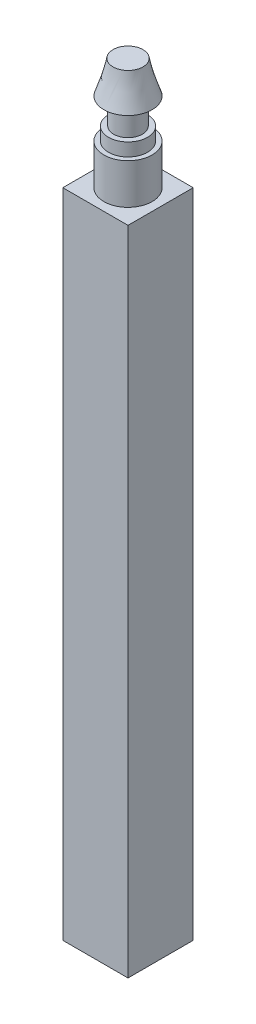
ISO-10303-21;
HEADER;
FILE_DESCRIPTION(('STEP AP214'),'2;1');
FILE_NAME('part.step','',(''),(''),'','','');
FILE_SCHEMA(('AUTOMOTIVE_DESIGN { 1 0 10303 214 1 1 1 1 }'));
ENDSEC;
DATA;
#1=APPLICATION_CONTEXT('core data for automotive mechanical design processes');
#2=APPLICATION_PROTOCOL_DEFINITION('international standard','automotive_design',2000,#1);
#3=PRODUCT_CONTEXT('',#1,'mechanical');
#4=PRODUCT('Part','Part','',(#3));
#5=PRODUCT_RELATED_PRODUCT_CATEGORY('part','',(#4));
#6=PRODUCT_DEFINITION_FORMATION('','',#4);
#7=PRODUCT_DEFINITION_CONTEXT('part definition',#1,'design');
#8=PRODUCT_DEFINITION('design','',#6,#7);
#9=PRODUCT_DEFINITION_SHAPE('','',#8);
#10=(LENGTH_UNIT() NAMED_UNIT(*) SI_UNIT(.MILLI.,.METRE.));
#11=(NAMED_UNIT(*) PLANE_ANGLE_UNIT() SI_UNIT($,.RADIAN.));
#12=(NAMED_UNIT(*) SI_UNIT($,.STERADIAN.) SOLID_ANGLE_UNIT());
#13=UNCERTAINTY_MEASURE_WITH_UNIT(LENGTH_MEASURE(1.E-05),#10,'distance_accuracy_value','');
#14=(GEOMETRIC_REPRESENTATION_CONTEXT(3) GLOBAL_UNCERTAINTY_ASSIGNED_CONTEXT((#13)) GLOBAL_UNIT_ASSIGNED_CONTEXT((#10,
#11,#12)) REPRESENTATION_CONTEXT('',''));
#15=CARTESIAN_POINT('',(0.,0.,0.));
#16=DIRECTION('',(0.,0.,1.));
#17=DIRECTION('',(1.,0.,0.));
#18=AXIS2_PLACEMENT_3D('',#15,#16,#17);
#19=CARTESIAN_POINT('',(0.,3.1,0.));
#20=DIRECTION('',(0.,-1.,0.));
#21=DIRECTION('',(0.,0.,-1.));
#22=AXIS2_PLACEMENT_3D('',#19,#20,#21);
#23=CYLINDRICAL_SURFACE('',#22,1.85);
#24=CARTESIAN_POINT('',(0.,3.1,0.));
#25=DIRECTION('',(0.,1.,0.));
#26=DIRECTION('',(0.,0.,1.));
#27=AXIS2_PLACEMENT_3D('',#24,#25,#26);
#28=CIRCLE('',#27,1.85);
#29=CARTESIAN_POINT('',(0.,3.1,-1.85));
#30=VERTEX_POINT('',#29);
#31=EDGE_CURVE('E175',#30,#30,#28,.T.);
#32=CARTESIAN_POINT('',(0.,0.,0.));
#33=DIRECTION('',(0.,1.,0.));
#34=DIRECTION('',(0.,0.,1.));
#35=AXIS2_PLACEMENT_3D('',#32,#33,#34);
#36=CIRCLE('',#35,1.85);
#37=CARTESIAN_POINT('',(0.,0.,-1.85));
#38=VERTEX_POINT('',#37);
#39=EDGE_CURVE('E42',#38,#38,#36,.T.);
#40=CARTESIAN_POINT('',(0.,3.1,-1.85));
#41=CARTESIAN_POINT('',(0.,3.06770833333333,-1.85));
#42=CARTESIAN_POINT('',(0.,3.03541666666667,-1.85));
#43=CARTESIAN_POINT('',(0.,2.97083333333333,-1.85));
#44=CARTESIAN_POINT('',(0.,2.93854166666667,-1.85));
#45=CARTESIAN_POINT('',(0.,2.87395833333333,-1.85));
#46=CARTESIAN_POINT('',(0.,2.84166666666667,-1.85));
#47=CARTESIAN_POINT('',(0.,2.77708333333333,-1.85));
#48=CARTESIAN_POINT('',(0.,2.74479166666667,-1.85));
#49=CARTESIAN_POINT('',(0.,2.68020833333333,-1.85));
#50=CARTESIAN_POINT('',(0.,2.64791666666667,-1.85));
#51=CARTESIAN_POINT('',(0.,2.58333333333333,-1.85));
#52=CARTESIAN_POINT('',(0.,2.55104166666667,-1.85));
#53=CARTESIAN_POINT('',(0.,2.48645833333333,-1.85));
#54=CARTESIAN_POINT('',(0.,2.45416666666667,-1.85));
#55=CARTESIAN_POINT('',(0.,2.38958333333333,-1.85));
#56=CARTESIAN_POINT('',(0.,2.35729166666667,-1.85));
#57=CARTESIAN_POINT('',(0.,2.29270833333333,-1.85));
#58=CARTESIAN_POINT('',(0.,2.26041666666667,-1.85));
#59=CARTESIAN_POINT('',(0.,2.19583333333333,-1.85));
#60=CARTESIAN_POINT('',(0.,2.16354166666667,-1.85));
#61=CARTESIAN_POINT('',(0.,2.09895833333333,-1.85));
#62=CARTESIAN_POINT('',(0.,2.06666666666667,-1.85));
#63=CARTESIAN_POINT('',(0.,2.00208333333333,-1.85));
#64=CARTESIAN_POINT('',(0.,1.96979166666667,-1.85));
#65=CARTESIAN_POINT('',(0.,1.90520833333333,-1.85));
#66=CARTESIAN_POINT('',(0.,1.87291666666667,-1.85));
#67=CARTESIAN_POINT('',(0.,1.80833333333333,-1.85));
#68=CARTESIAN_POINT('',(0.,1.77604166666667,-1.85));
#69=CARTESIAN_POINT('',(0.,1.71145833333333,-1.85));
#70=CARTESIAN_POINT('',(0.,1.67916666666667,-1.85));
#71=CARTESIAN_POINT('',(0.,1.61458333333333,-1.85));
#72=CARTESIAN_POINT('',(0.,1.58229166666667,-1.85));
#73=CARTESIAN_POINT('',(0.,1.51770833333333,-1.85));
#74=CARTESIAN_POINT('',(0.,1.48541666666667,-1.85));
#75=CARTESIAN_POINT('',(0.,1.42083333333333,-1.85));
#76=CARTESIAN_POINT('',(0.,1.38854166666667,-1.85));
#77=CARTESIAN_POINT('',(0.,1.32395833333333,-1.85));
#78=CARTESIAN_POINT('',(0.,1.29166666666667,-1.85));
#79=CARTESIAN_POINT('',(0.,1.22708333333333,-1.85));
#80=CARTESIAN_POINT('',(0.,1.19479166666667,-1.85));
#81=CARTESIAN_POINT('',(0.,1.13020833333333,-1.85));
#82=CARTESIAN_POINT('',(0.,1.09791666666667,-1.85));
#83=CARTESIAN_POINT('',(0.,1.03333333333333,-1.85));
#84=CARTESIAN_POINT('',(0.,1.00104166666667,-1.85));
#85=CARTESIAN_POINT('',(0.,0.936458333333333,-1.85));
#86=CARTESIAN_POINT('',(0.,0.904166666666667,-1.85));
#87=CARTESIAN_POINT('',(0.,0.839583333333333,-1.85));
#88=CARTESIAN_POINT('',(0.,0.807291666666667,-1.85));
#89=CARTESIAN_POINT('',(0.,0.742708333333333,-1.85));
#90=CARTESIAN_POINT('',(0.,0.710416666666667,-1.85));
#91=CARTESIAN_POINT('',(0.,0.645833333333333,-1.85));
#92=CARTESIAN_POINT('',(0.,0.613541666666667,-1.85));
#93=CARTESIAN_POINT('',(0.,0.548958333333333,-1.85));
#94=CARTESIAN_POINT('',(0.,0.516666666666667,-1.85));
#95=CARTESIAN_POINT('',(0.,0.452083333333333,-1.85));
#96=CARTESIAN_POINT('',(0.,0.419791666666667,-1.85));
#97=CARTESIAN_POINT('',(0.,0.355208333333333,-1.85));
#98=CARTESIAN_POINT('',(0.,0.322916666666667,-1.85));
#99=CARTESIAN_POINT('',(0.,0.258333333333333,-1.85));
#100=CARTESIAN_POINT('',(0.,0.226041666666667,-1.85));
#101=CARTESIAN_POINT('',(0.,0.161458333333333,-1.85));
#102=CARTESIAN_POINT('',(0.,0.129166666666667,-1.85));
#103=CARTESIAN_POINT('',(0.,0.0645833333333335,-1.85));
#104=CARTESIAN_POINT('',(0.,0.0322916666666667,-1.85));
#105=CARTESIAN_POINT('',(0.,0.,-1.85));
#106=B_SPLINE_CURVE_WITH_KNOTS('',3,(#40,#41,#42,#43,#44,#45,#46,#47,#48,#49,#50,#51,#52,#53,
#54,#55,#56,#57,#58,#59,#60,#61,#62,#63,#64,#65,#66,#67,#68,#69,#70,#71,#72,#73,#74,#75,#76,#77,
#78,#79,#80,#81,#82,#83,#84,#85,#86,#87,#88,#89,#90,#91,#92,#93,#94,#95,#96,#97,#98,#99,#100,
#101,#102,#103,#104,#105),.UNSPECIFIED.,.F.,.F.,(4,2,2,2,2,2,2,2,2,2,2,2,2,2,2,2,2,2,2,2,2,2,2,
2,2,2,2,2,2,2,2,2,4),(0.,0.0968749999999997,0.19375,0.290625,0.3875,0.484375,0.58125,0.678125,
0.775,0.871874999999999,0.96875,1.065625,1.1625,1.259375,1.35625,1.453125,1.55,1.646875,1.74375,
1.840625,1.9375,2.034375,2.13125,2.228125,2.325,2.421875,2.51875,2.615625,2.7125,2.809375,
2.90625,3.003125,3.1),.UNSPECIFIED.);
#107=EDGE_CURVE('BSEAM39',#30,#38,#106,.T.);
#108=ORIENTED_EDGE('',*,*,#31,.F.);
#109=ORIENTED_EDGE('',*,*,#39,.T.);
#110=ORIENTED_EDGE('',*,*,#107,.T.);
#111=ORIENTED_EDGE('',*,*,#107,.F.);
#112=EDGE_LOOP('',(#108,#110,#109,#111));
#113=FACE_BOUND('',#112,.T.);
#114=ADVANCED_FACE('F39',(#113),#23,.T.);
#115=CARTESIAN_POINT('',(0.,3.1,0.));
#116=DIRECTION('',(0.,1.,0.));
#117=DIRECTION('',(0.,0.,1.));
#118=AXIS2_PLACEMENT_3D('',#115,#116,#117);
#119=PLANE('',#118);
#120=CARTESIAN_POINT('',(0.,3.1,0.));
#121=DIRECTION('',(0.,1.,0.));
#122=DIRECTION('',(0.,0.,1.));
#123=AXIS2_PLACEMENT_3D('',#120,#121,#122);
#124=CIRCLE('',#123,1.5);
#125=CARTESIAN_POINT('',(0.,3.1,1.5));
#126=VERTEX_POINT('',#125);
#127=EDGE_CURVE('E48',#126,#126,#124,.T.);
#128=ORIENTED_EDGE('',*,*,#127,.F.);
#129=EDGE_LOOP('',(#128));
#130=FACE_BOUND('',#129,.T.);
#131=ORIENTED_EDGE('',*,*,#31,.T.);
#132=EDGE_LOOP('',(#131));
#133=FACE_BOUND('',#132,.T.);
#134=ADVANCED_FACE('F180',(#130,#133),#119,.T.);
#135=CARTESIAN_POINT('',(0.,4.1,0.));
#136=DIRECTION('',(0.,-1.,0.));
#137=DIRECTION('',(0.,0.,-1.));
#138=AXIS2_PLACEMENT_3D('',#135,#136,#137);
#139=CYLINDRICAL_SURFACE('',#138,1.5);
#140=CARTESIAN_POINT('',(0.,4.1,0.));
#141=DIRECTION('',(0.,1.,0.));
#142=DIRECTION('',(0.,0.,1.));
#143=AXIS2_PLACEMENT_3D('',#140,#141,#142);
#144=CIRCLE('',#143,1.5);
#145=CARTESIAN_POINT('',(0.,4.1,1.5));
#146=VERTEX_POINT('',#145);
#147=EDGE_CURVE('E171',#146,#146,#144,.T.);
#148=ORIENTED_EDGE('',*,*,#147,.F.);
#149=EDGE_LOOP('',(#148));
#150=FACE_BOUND('',#149,.T.);
#151=ORIENTED_EDGE('',*,*,#127,.T.);
#152=EDGE_LOOP('',(#151));
#153=FACE_BOUND('',#152,.T.);
#154=ADVANCED_FACE('F203',(#150,#153),#139,.T.);
#155=CARTESIAN_POINT('',(0.,4.1,0.));
#156=DIRECTION('',(0.,1.,0.));
#157=DIRECTION('',(0.,0.,1.));
#158=AXIS2_PLACEMENT_3D('',#155,#156,#157);
#159=PLANE('',#158);
#160=CARTESIAN_POINT('',(0.,4.1,0.));
#161=DIRECTION('',(0.,1.,0.));
#162=DIRECTION('',(0.,0.,1.));
#163=AXIS2_PLACEMENT_3D('',#160,#161,#162);
#164=CIRCLE('',#163,1.1);
#165=CARTESIAN_POINT('',(0.,4.1,1.1));
#166=VERTEX_POINT('',#165);
#167=EDGE_CURVE('E12',#166,#166,#164,.T.);
#168=ORIENTED_EDGE('',*,*,#167,.F.);
#169=EDGE_LOOP('',(#168));
#170=FACE_BOUND('',#169,.T.);
#171=ORIENTED_EDGE('',*,*,#147,.T.);
#172=EDGE_LOOP('',(#171));
#173=FACE_BOUND('',#172,.T.);
#174=ADVANCED_FACE('F198',(#170,#173),#159,.T.);
#175=CARTESIAN_POINT('',(0.,6.1,0.));
#176=DIRECTION('',(0.,-1.,0.));
#177=DIRECTION('',(0.,0.,-1.));
#178=AXIS2_PLACEMENT_3D('',#175,#176,#177);
#179=CYLINDRICAL_SURFACE('',#178,1.1);
#180=CARTESIAN_POINT('',(0.,6.1,0.));
#181=DIRECTION('',(0.,1.,0.));
#182=DIRECTION('',(0.,0.,1.));
#183=AXIS2_PLACEMENT_3D('',#180,#181,#182);
#184=CIRCLE('',#183,1.1);
#185=CARTESIAN_POINT('',(0.,6.1,1.1));
#186=VERTEX_POINT('',#185);
#187=EDGE_CURVE('E167',#186,#186,#184,.T.);
#188=ORIENTED_EDGE('',*,*,#187,.F.);
#189=EDGE_LOOP('',(#188));
#190=FACE_BOUND('',#189,.T.);
#191=ORIENTED_EDGE('',*,*,#167,.T.);
#192=EDGE_LOOP('',(#191));
#193=FACE_BOUND('',#192,.T.);
#194=ADVANCED_FACE('F154',(#190,#193),#179,.T.);
#195=CARTESIAN_POINT('',(0.,8.6,0.));
#196=DIRECTION('',(0.,1.,0.));
#197=DIRECTION('',(0.,0.,1.));
#198=AXIS2_PLACEMENT_3D('',#195,#196,#197);
#199=PLANE('',#198);
#200=CARTESIAN_POINT('',(0.,8.6,0.));
#201=DIRECTION('',(0.,1.,0.));
#202=DIRECTION('',(0.,0.,1.));
#203=AXIS2_PLACEMENT_3D('',#200,#201,#202);
#204=CIRCLE('',#203,1.15);
#205=CARTESIAN_POINT('',(0.620465420838555,8.6,0.968257538851949));
#206=VERTEX_POINT('',#205);
#207=EDGE_CURVE('E122',#206,#206,#204,.T.);
#208=ORIENTED_EDGE('',*,*,#207,.T.);
#209=EDGE_LOOP('',(#208));
#210=FACE_BOUND('',#209,.T.);
#211=ADVANCED_FACE('F145',(#210),#199,.T.);
#212=CARTESIAN_POINT('',(0.,6.1,0.));
#213=DIRECTION('',(0.,1.,0.));
#214=DIRECTION('',(0.,0.,1.));
#215=AXIS2_PLACEMENT_3D('',#212,#213,#214);
#216=PLANE('',#215);
#217=ORIENTED_EDGE('',*,*,#187,.T.);
#218=EDGE_LOOP('',(#217));
#219=FACE_BOUND('',#218,.T.);
#220=CARTESIAN_POINT('',(0.,6.1,0.));
#221=DIRECTION('',(0.,1.,0.));
#222=DIRECTION('',(0.,0.,1.));
#223=AXIS2_PLACEMENT_3D('',#220,#221,#222);
#224=CIRCLE('',#223,1.85);
#225=CARTESIAN_POINT('',(0.,6.1,1.85));
#226=VERTEX_POINT('',#225);
#227=EDGE_CURVE('E127',#226,#226,#224,.T.);
#228=ORIENTED_EDGE('',*,*,#227,.F.);
#229=EDGE_LOOP('',(#228));
#230=FACE_BOUND('',#229,.T.);
#231=ADVANCED_FACE('F142',(#219,#230),#216,.F.);
#232=CARTESIAN_POINT('',(0.,6.1,1.85));
#233=CARTESIAN_POINT('',(0.620465420838555,8.6,0.968257538851949));
#234=CARTESIAN_POINT('',(3.7,6.1,1.85));
#235=CARTESIAN_POINT('',(2.55698049854245,8.6,-0.272673302825161));
#236=CARTESIAN_POINT('',(3.7,6.1,-1.85));
#237=CARTESIAN_POINT('',(1.31604965686534,8.6,-2.20918838052906));
#238=CARTESIAN_POINT('',(0.,6.1,-1.85));
#239=CARTESIAN_POINT('',(-0.620465420838555,8.6,-0.96825753885195));
#240=CARTESIAN_POINT('',(-3.7,6.1,-1.85));
#241=CARTESIAN_POINT('',(-2.55698049854246,8.6,0.272673302825162));
#242=CARTESIAN_POINT('',(-3.7,6.1,1.85));
#243=CARTESIAN_POINT('',(-1.31604965686534,8.6,2.20918838052906));
#244=CARTESIAN_POINT('',(0.,6.1,1.85));
#245=CARTESIAN_POINT('',(0.620465420838555,8.6,0.968257538851949));
#246=(BOUNDED_SURFACE() B_SPLINE_SURFACE(3,1,((#232,#233),(#234,#235),(#236,#237),(#238,#239),
(#240,#241),(#242,#243),(#244,#245)),.UNSPECIFIED.,.T.,.F.,.F.) B_SPLINE_SURFACE_WITH_KNOTS((4,
3,4),(2,2),(0.,0.5,1.),(0.,1.),
.UNSPECIFIED.) GEOMETRIC_REPRESENTATION_ITEM() RATIONAL_B_SPLINE_SURFACE(((1.,1.),
(0.333333333333333,0.333333333333333),(0.333333333333333,0.333333333333333),(1.,1.),
(0.333333333333333,0.333333333333333),(0.333333333333333,0.333333333333333),(1.,1.))) REPRESENTATION_ITEM('') SURFACE());
#247=CARTESIAN_POINT('',(0.,6.1,1.85));
#248=CARTESIAN_POINT('',(0.00646318146706835,6.12604166666667,1.84081518269637));
#249=CARTESIAN_POINT('',(0.0129263629341366,6.15208333333333,1.83163036539275));
#250=CARTESIAN_POINT('',(0.0258527258682731,6.20416666666667,1.8132607307855));
#251=CARTESIAN_POINT('',(0.0323159073353414,6.23020833333333,1.80407591348187));
#252=CARTESIAN_POINT('',(0.045242270269478,6.28229166666667,1.78570627887462));
#253=CARTESIAN_POINT('',(0.0517054517365463,6.30833333333333,1.776521461571));
#254=CARTESIAN_POINT('',(0.0646318146706829,6.36041666666667,1.75815182696374));
#255=CARTESIAN_POINT('',(0.0710949961377511,6.38645833333333,1.74896700966012));
#256=CARTESIAN_POINT('',(0.0840213590718877,6.43854166666667,1.73059737505287));
#257=CARTESIAN_POINT('',(0.090484540538956,6.46458333333333,1.72141255774924));
#258=CARTESIAN_POINT('',(0.103410903473093,6.51666666666667,1.70304292314199));
#259=CARTESIAN_POINT('',(0.109874084940161,6.54270833333333,1.69385810583837));
#260=CARTESIAN_POINT('',(0.122800447874297,6.59479166666667,1.67548847123112));
#261=CARTESIAN_POINT('',(0.129263629341366,6.62083333333333,1.66630365392749));
#262=CARTESIAN_POINT('',(0.142189992275502,6.67291666666667,1.64793401932024));
#263=CARTESIAN_POINT('',(0.148653173742571,6.69895833333333,1.63874920201661));
#264=CARTESIAN_POINT('',(0.161579536676707,6.75104166666667,1.62037956740936));
#265=CARTESIAN_POINT('',(0.168042718143775,6.77708333333333,1.61119475010574));
#266=CARTESIAN_POINT('',(0.180969081077912,6.82916666666667,1.59282511549849));
#267=CARTESIAN_POINT('',(0.18743226254498,6.85520833333333,1.58364029819486));
#268=CARTESIAN_POINT('',(0.200358625479117,6.90729166666667,1.56527066358761));
#269=CARTESIAN_POINT('',(0.206821806946185,6.93333333333333,1.55608584628398));
#270=CARTESIAN_POINT('',(0.219748169880322,6.98541666666667,1.53771621167673));
#271=CARTESIAN_POINT('',(0.22621135134739,7.01145833333333,1.52853139437311));
#272=CARTESIAN_POINT('',(0.239137714281527,7.06354166666667,1.51016175976586));
#273=CARTESIAN_POINT('',(0.245600895748595,7.08958333333333,1.50097694246223));
#274=CARTESIAN_POINT('',(0.258527258682731,7.14166666666667,1.48260730785498));
#275=CARTESIAN_POINT('',(0.2649904401498,7.16770833333333,1.47342249055135));
#276=CARTESIAN_POINT('',(0.277916803083936,7.21979166666667,1.4550528559441));
#277=CARTESIAN_POINT('',(0.284379984551005,7.24583333333333,1.44586803864048));
#278=CARTESIAN_POINT('',(0.297306347485141,7.29791666666667,1.42749840403323));
#279=CARTESIAN_POINT('',(0.303769528952209,7.32395833333333,1.4183135867296));
#280=CARTESIAN_POINT('',(0.316695891886346,7.37604166666667,1.39994395212235));
#281=CARTESIAN_POINT('',(0.323159073353414,7.40208333333333,1.39075913481872));
#282=CARTESIAN_POINT('',(0.336085436287551,7.45416666666667,1.37238950021147));
#283=CARTESIAN_POINT('',(0.342548617754619,7.48020833333333,1.36320468290785));
#284=CARTESIAN_POINT('',(0.355474980688756,7.53229166666667,1.3448350483006));
#285=CARTESIAN_POINT('',(0.361938162155824,7.55833333333333,1.33565023099697));
#286=CARTESIAN_POINT('',(0.374864525089961,7.61041666666667,1.31728059638972));
#287=CARTESIAN_POINT('',(0.381327706557029,7.63645833333333,1.30809577908609));
#288=CARTESIAN_POINT('',(0.394254069491165,7.68854166666667,1.28972614447884));
#289=CARTESIAN_POINT('',(0.400717250958234,7.71458333333333,1.28054132717522));
#290=CARTESIAN_POINT('',(0.41364361389237,7.76666666666667,1.26217169256797));
#291=CARTESIAN_POINT('',(0.420106795359439,7.79270833333333,1.25298687526434));
#292=CARTESIAN_POINT('',(0.433033158293575,7.84479166666667,1.23461724065709));
#293=CARTESIAN_POINT('',(0.439496339760643,7.87083333333333,1.22543242335346));
#294=CARTESIAN_POINT('',(0.45242270269478,7.92291666666667,1.20706278874621));
#295=CARTESIAN_POINT('',(0.458885884161848,7.94895833333333,1.19787797144259));
#296=CARTESIAN_POINT('',(0.471812247095985,8.00104166666667,1.17950833683534));
#297=CARTESIAN_POINT('',(0.478275428563053,8.02708333333333,1.17032351953171));
#298=CARTESIAN_POINT('',(0.49120179149719,8.07916666666667,1.15195388492446));
#299=CARTESIAN_POINT('',(0.497664972964258,8.10520833333333,1.14276906762083));
#300=CARTESIAN_POINT('',(0.510591335898395,8.15729166666667,1.12439943301358));
#301=CARTESIAN_POINT('',(0.517054517365463,8.18333333333333,1.11521461570996));
#302=CARTESIAN_POINT('',(0.529980880299599,8.23541666666667,1.09684498110271));
#303=CARTESIAN_POINT('',(0.536444061766668,8.26145833333333,1.08766016379908));
#304=CARTESIAN_POINT('',(0.549370424700804,8.31354166666667,1.06929052919183));
#305=CARTESIAN_POINT('',(0.555833606167872,8.33958333333333,1.0601057118882));
#306=CARTESIAN_POINT('',(0.568759969102009,8.39166666666667,1.04173607728095));
#307=CARTESIAN_POINT('',(0.575223150569077,8.41770833333333,1.03255125997733));
#308=CARTESIAN_POINT('',(0.588149513503214,8.46979166666667,1.01418162537008));
#309=CARTESIAN_POINT('',(0.594612694970282,8.49583333333333,1.00499680806645));
#310=CARTESIAN_POINT('',(0.607539057904419,8.54791666666667,0.9866271734592));
#311=CARTESIAN_POINT('',(0.614002239371487,8.57395833333333,0.977442356155575));
#312=CARTESIAN_POINT('',(0.620465420838555,8.6,0.968257538851949));
#313=B_SPLINE_CURVE_WITH_KNOTS('',3,(#247,#248,#249,#250,#251,#252,#253,#254,#255,#256,#257,
#258,#259,#260,#261,#262,#263,#264,#265,#266,#267,#268,#269,#270,#271,#272,#273,#274,#275,#276,
#277,#278,#279,#280,#281,#282,#283,#284,#285,#286,#287,#288,#289,#290,#291,#292,#293,#294,#295,
#296,#297,#298,#299,#300,#301,#302,#303,#304,#305,#306,#307,#308,#309,#310,#311,#312),
.UNSPECIFIED.,.F.,.F.,(4,2,2,2,2,2,2,2,2,2,2,2,2,2,2,2,2,2,2,2,2,2,2,2,2,2,2,2,2,2,2,2,4),(0.,
0.0850806551290898,0.17016131025818,0.255241965387269,0.340322620516359,0.425403275645449,
0.510483930774539,0.595564585903629,0.680645241032718,0.765725896161807,0.850806551290897,
0.935887206419988,1.02096786154908,1.10604851667817,1.19112917180726,1.27620982693635,
1.36129048206544,1.44637113719453,1.53145179232361,1.6165324474527,1.70161310258179,
1.78669375771088,1.87177441283997,1.95685506796906,2.04193572309815,2.12701637822724,
2.21209703335633,2.29717768848542,2.38225834361451,2.4673389987436,2.55241965387269,
2.63750030900178,2.72258096413087),.UNSPECIFIED.);
#314=EDGE_CURVE('BSEAM129',#226,#206,#313,.T.);
#315=ORIENTED_EDGE('',*,*,#227,.T.);
#316=ORIENTED_EDGE('',*,*,#207,.F.);
#317=ORIENTED_EDGE('',*,*,#314,.T.);
#318=ORIENTED_EDGE('',*,*,#314,.F.);
#319=EDGE_LOOP('',(#315,#317,#316,#318));
#320=FACE_BOUND('',#319,.T.);
#321=ADVANCED_FACE('F129',(#320),#246,.T.);
#322=CARTESIAN_POINT('',(2.5,-50.,2.5));
#323=DIRECTION('',(-1.,0.,0.));
#324=DIRECTION('',(0.,0.,1.));
#325=AXIS2_PLACEMENT_3D('',#322,#323,#324);
#326=PLANE('',#325);
#327=DIRECTION('',(0.,0.,1.));
#328=VECTOR('',#327,1.);
#329=CARTESIAN_POINT('',(2.5,0.,2.5));
#330=LINE('',#329,#328);
#331=CARTESIAN_POINT('',(2.5,0.,-2.5));
#332=VERTEX_POINT('',#331);
#333=CARTESIAN_POINT('',(2.5,0.,2.5));
#334=VERTEX_POINT('',#333);
#335=EDGE_CURVE('E108',#332,#334,#330,.T.);
#336=ORIENTED_EDGE('',*,*,#335,.T.);
#337=DIRECTION('',(0.,1.,0.));
#338=VECTOR('',#337,1.);
#339=CARTESIAN_POINT('',(2.5,-50.,2.5));
#340=LINE('',#339,#338);
#341=CARTESIAN_POINT('',(2.5,-50.,2.5));
#342=VERTEX_POINT('',#341);
#343=EDGE_CURVE('E99',#342,#334,#340,.T.);
#344=ORIENTED_EDGE('',*,*,#343,.F.);
#345=DIRECTION('',(0.,0.,1.));
#346=VECTOR('',#345,1.);
#347=CARTESIAN_POINT('',(2.5,-50.,2.5));
#348=LINE('',#347,#346);
#349=CARTESIAN_POINT('',(2.5,-50.,-2.5));
#350=VERTEX_POINT('',#349);
#351=EDGE_CURVE('E93',#350,#342,#348,.T.);
#352=ORIENTED_EDGE('',*,*,#351,.F.);
#353=DIRECTION('',(0.,1.,0.));
#354=VECTOR('',#353,1.);
#355=CARTESIAN_POINT('',(2.5,-50.,-2.5));
#356=LINE('',#355,#354);
#357=EDGE_CURVE('E104',#350,#332,#356,.T.);
#358=ORIENTED_EDGE('',*,*,#357,.T.);
#359=EDGE_LOOP('',(#336,#344,#352,#358));
#360=FACE_BOUND('',#359,.T.);
#361=ADVANCED_FACE('F141',(#360),#326,.F.);
#362=CARTESIAN_POINT('',(-2.5,-50.,2.5));
#363=DIRECTION('',(0.,0.,-1.));
#364=DIRECTION('',(-1.,0.,0.));
#365=AXIS2_PLACEMENT_3D('',#362,#363,#364);
#366=PLANE('',#365);
#367=DIRECTION('',(-1.,0.,0.));
#368=VECTOR('',#367,1.);
#369=CARTESIAN_POINT('',(-2.5,0.,2.5));
#370=LINE('',#369,#368);
#371=CARTESIAN_POINT('',(-2.5,0.,2.5));
#372=VERTEX_POINT('',#371);
#373=EDGE_CURVE('E98',#334,#372,#370,.T.);
#374=ORIENTED_EDGE('',*,*,#373,.T.);
#375=DIRECTION('',(0.,1.,0.));
#376=VECTOR('',#375,1.);
#377=CARTESIAN_POINT('',(-2.5,-50.,2.5));
#378=LINE('',#377,#376);
#379=CARTESIAN_POINT('',(-2.5,-50.,2.5));
#380=VERTEX_POINT('',#379);
#381=EDGE_CURVE('E96',#380,#372,#378,.T.);
#382=ORIENTED_EDGE('',*,*,#381,.F.);
#383=DIRECTION('',(-1.,0.,0.));
#384=VECTOR('',#383,1.);
#385=CARTESIAN_POINT('',(-2.5,-50.,2.5));
#386=LINE('',#385,#384);
#387=EDGE_CURVE('E88',#342,#380,#386,.T.);
#388=ORIENTED_EDGE('',*,*,#387,.F.);
#389=ORIENTED_EDGE('',*,*,#343,.T.);
#390=EDGE_LOOP('',(#374,#382,#388,#389));
#391=FACE_BOUND('',#390,.T.);
#392=ADVANCED_FACE('F97',(#391),#366,.F.);
#393=CARTESIAN_POINT('',(-2.5,-50.,2.5));
#394=DIRECTION('',(1.,0.,0.));
#395=DIRECTION('',(0.,0.,-1.));
#396=AXIS2_PLACEMENT_3D('',#393,#394,#395);
#397=PLANE('',#396);
#398=DIRECTION('',(0.,0.,-1.));
#399=VECTOR('',#398,1.);
#400=CARTESIAN_POINT('',(-2.5,0.,2.5));
#401=LINE('',#400,#399);
#402=CARTESIAN_POINT('',(-2.5,0.,-2.5));
#403=VERTEX_POINT('',#402);
#404=EDGE_CURVE('E74',#372,#403,#401,.T.);
#405=ORIENTED_EDGE('',*,*,#404,.T.);
#406=DIRECTION('',(0.,1.,0.));
#407=VECTOR('',#406,1.);
#408=CARTESIAN_POINT('',(-2.5,-50.,-2.5));
#409=LINE('',#408,#407);
#410=CARTESIAN_POINT('',(-2.5,-50.,-2.5));
#411=VERTEX_POINT('',#410);
#412=EDGE_CURVE('E100',#411,#403,#409,.T.);
#413=ORIENTED_EDGE('',*,*,#412,.F.);
#414=DIRECTION('',(0.,0.,-1.));
#415=VECTOR('',#414,1.);
#416=CARTESIAN_POINT('',(-2.5,-50.,2.5));
#417=LINE('',#416,#415);
#418=EDGE_CURVE('E91',#380,#411,#417,.T.);
#419=ORIENTED_EDGE('',*,*,#418,.F.);
#420=ORIENTED_EDGE('',*,*,#381,.T.);
#421=EDGE_LOOP('',(#405,#413,#419,#420));
#422=FACE_BOUND('',#421,.T.);
#423=ADVANCED_FACE('F102',(#422),#397,.F.);
#424=CARTESIAN_POINT('',(-2.5,-50.,-2.5));
#425=DIRECTION('',(0.,0.,1.));
#426=DIRECTION('',(1.,0.,0.));
#427=AXIS2_PLACEMENT_3D('',#424,#425,#426);
#428=PLANE('',#427);
#429=DIRECTION('',(1.,0.,0.));
#430=VECTOR('',#429,1.);
#431=CARTESIAN_POINT('',(-2.5,0.,-2.5));
#432=LINE('',#431,#430);
#433=EDGE_CURVE('E80',#403,#332,#432,.T.);
#434=ORIENTED_EDGE('',*,*,#433,.T.);
#435=ORIENTED_EDGE('',*,*,#357,.F.);
#436=DIRECTION('',(1.,0.,0.));
#437=VECTOR('',#436,1.);
#438=CARTESIAN_POINT('',(-2.5,-50.,-2.5));
#439=LINE('',#438,#437);
#440=EDGE_CURVE('E57',#411,#350,#439,.T.);
#441=ORIENTED_EDGE('',*,*,#440,.F.);
#442=ORIENTED_EDGE('',*,*,#412,.T.);
#443=EDGE_LOOP('',(#434,#435,#441,#442));
#444=FACE_BOUND('',#443,.T.);
#445=ADVANCED_FACE('F267',(#444),#428,.F.);
#446=CARTESIAN_POINT('',(0.,-50.,0.));
#447=DIRECTION('',(0.,-1.,0.));
#448=DIRECTION('',(0.,0.,-1.));
#449=AXIS2_PLACEMENT_3D('',#446,#447,#448);
#450=PLANE('',#449);
#451=CARTESIAN_POINT('',(0.,-50.,0.));
#452=DIRECTION('',(0.,-1.,0.));
#453=DIRECTION('',(0.,0.,-1.));
#454=AXIS2_PLACEMENT_3D('',#451,#452,#453);
#455=CIRCLE('',#454,1.);
#456=CARTESIAN_POINT('',(0.,-50.,-1.));
#457=VERTEX_POINT('',#456);
#458=EDGE_CURVE('E319',#457,#457,#455,.T.);
#459=ORIENTED_EDGE('',*,*,#458,.F.);
#460=EDGE_LOOP('',(#459));
#461=FACE_BOUND('',#460,.T.);
#462=ORIENTED_EDGE('',*,*,#351,.T.);
#463=ORIENTED_EDGE('',*,*,#387,.T.);
#464=ORIENTED_EDGE('',*,*,#418,.T.);
#465=ORIENTED_EDGE('',*,*,#440,.T.);
#466=EDGE_LOOP('',(#462,#463,#464,#465));
#467=FACE_BOUND('',#466,.T.);
#468=ADVANCED_FACE('F89',(#461,#467),#450,.T.);
#469=CARTESIAN_POINT('',(0.,0.,0.));
#470=DIRECTION('',(0.,-1.,0.));
#471=DIRECTION('',(0.,0.,-1.));
#472=AXIS2_PLACEMENT_3D('',#469,#470,#471);
#473=PLANE('',#472);
#474=ORIENTED_EDGE('',*,*,#39,.F.);
#475=EDGE_LOOP('',(#474));
#476=FACE_BOUND('',#475,.T.);
#477=ORIENTED_EDGE('',*,*,#335,.F.);
#478=ORIENTED_EDGE('',*,*,#433,.F.);
#479=ORIENTED_EDGE('',*,*,#404,.F.);
#480=ORIENTED_EDGE('',*,*,#373,.F.);
#481=EDGE_LOOP('',(#477,#478,#479,#480));
#482=FACE_BOUND('',#481,.T.);
#483=ADVANCED_FACE('F282',(#476,#482),#473,.F.);
#484=CARTESIAN_POINT('',(0.,-26.,0.));
#485=DIRECTION('',(0.,-1.,0.));
#486=DIRECTION('',(0.,0.,-1.));
#487=AXIS2_PLACEMENT_3D('',#484,#485,#486);
#488=CYLINDRICAL_SURFACE('',#487,1.);
#489=CARTESIAN_POINT('',(0.,-26.,0.));
#490=DIRECTION('',(0.,-1.,0.));
#491=DIRECTION('',(0.,0.,-1.));
#492=AXIS2_PLACEMENT_3D('',#489,#490,#491);
#493=CIRCLE('',#492,1.);
#494=CARTESIAN_POINT('',(0.,-26.,-1.));
#495=VERTEX_POINT('',#494);
#496=EDGE_CURVE('E111',#495,#495,#493,.T.);
#497=ORIENTED_EDGE('',*,*,#496,.F.);
#498=EDGE_LOOP('',(#497));
#499=FACE_BOUND('',#498,.T.);
#500=ORIENTED_EDGE('',*,*,#458,.T.);
#501=EDGE_LOOP('',(#500));
#502=FACE_BOUND('',#501,.T.);
#503=ADVANCED_FACE('F287',(#499,#502),#488,.F.);
#504=CARTESIAN_POINT('',(0.,-26.,0.));
#505=DIRECTION('',(0.,-1.,0.));
#506=DIRECTION('',(0.,0.,-1.));
#507=AXIS2_PLACEMENT_3D('',#504,#505,#506);
#508=PLANE('',#507);
#509=ORIENTED_EDGE('',*,*,#496,.T.);
#510=EDGE_LOOP('',(#509));
#511=FACE_BOUND('',#510,.T.);
#512=ADVANCED_FACE('F303',(#511),#508,.T.);
#513=CLOSED_SHELL('',(#114,#134,#154,#174,#194,#211,#231,#321,#361,#392,#423,#445,#468,#483,
#503,#512));
#514=MANIFOLD_SOLID_BREP('B2',#513);
#515=ADVANCED_BREP_SHAPE_REPRESENTATION('',(#18,#514),#14);
#516=SHAPE_DEFINITION_REPRESENTATION(#9,#515);
ENDSEC;
END-ISO-10303-21;
